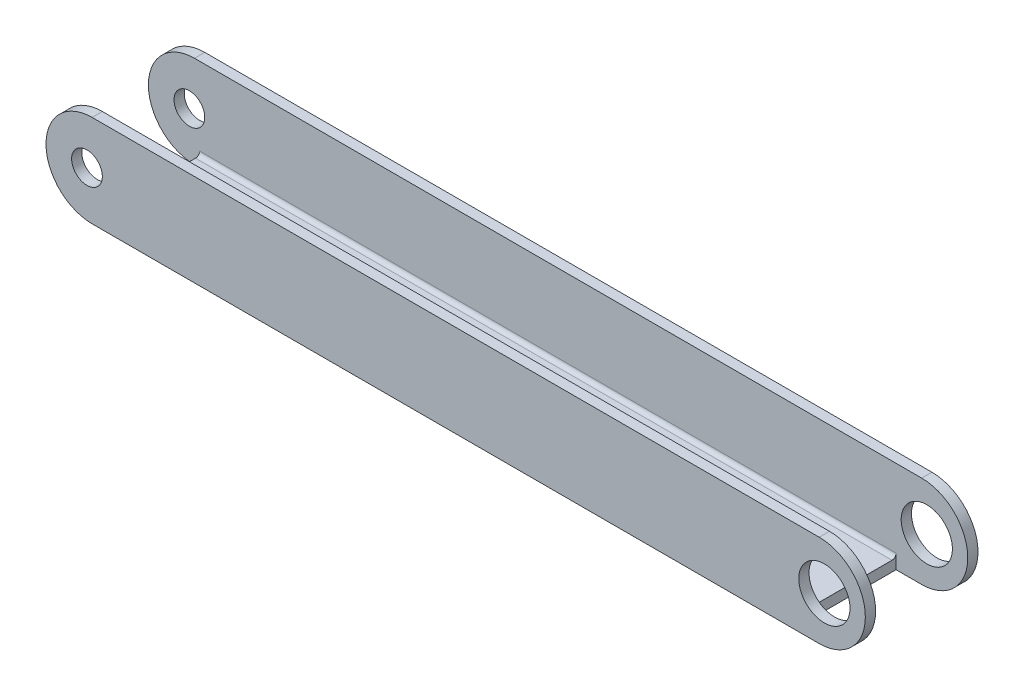
ISO-10303-21;
HEADER;
FILE_DESCRIPTION(('STEP AP214'),'2;1');
FILE_NAME('part.step','',(''),(''),'','','');
FILE_SCHEMA(('AUTOMOTIVE_DESIGN { 1 0 10303 214 1 1 1 1 }'));
ENDSEC;
DATA;
#1=APPLICATION_CONTEXT('core data for automotive mechanical design processes');
#2=APPLICATION_PROTOCOL_DEFINITION('international standard','automotive_design',2000,#1);
#3=PRODUCT_CONTEXT('',#1,'mechanical');
#4=PRODUCT('Part','Part','',(#3));
#5=PRODUCT_RELATED_PRODUCT_CATEGORY('part','',(#4));
#6=PRODUCT_DEFINITION_FORMATION('','',#4);
#7=PRODUCT_DEFINITION_CONTEXT('part definition',#1,'design');
#8=PRODUCT_DEFINITION('design','',#6,#7);
#9=PRODUCT_DEFINITION_SHAPE('','',#8);
#10=(LENGTH_UNIT() NAMED_UNIT(*) SI_UNIT(.MILLI.,.METRE.));
#11=(NAMED_UNIT(*) PLANE_ANGLE_UNIT() SI_UNIT($,.RADIAN.));
#12=(NAMED_UNIT(*) SI_UNIT($,.STERADIAN.) SOLID_ANGLE_UNIT());
#13=UNCERTAINTY_MEASURE_WITH_UNIT(LENGTH_MEASURE(1.E-05),#10,'distance_accuracy_value','');
#14=(GEOMETRIC_REPRESENTATION_CONTEXT(3) GLOBAL_UNCERTAINTY_ASSIGNED_CONTEXT((#13)) GLOBAL_UNIT_ASSIGNED_CONTEXT((#10,
#11,#12)) REPRESENTATION_CONTEXT('',''));
#15=CARTESIAN_POINT('',(0.,0.,0.));
#16=DIRECTION('',(0.,0.,1.));
#17=DIRECTION('',(1.,0.,0.));
#18=AXIS2_PLACEMENT_3D('',#15,#16,#17);
#19=CARTESIAN_POINT('',(177.5,17.5,27.5));
#20=DIRECTION('',(0.,0.,-1.));
#21=DIRECTION('',(-1.,0.,0.));
#22=AXIS2_PLACEMENT_3D('',#19,#20,#21);
#23=CYLINDRICAL_SURFACE('',#22,22.5);
#24=DIRECTION('',(0.,0.,1.));
#25=VECTOR('',#24,1.);
#26=CARTESIAN_POINT('',(177.5,40.,27.5));
#27=LINE('',#26,#25);
#28=CARTESIAN_POINT('',(177.5,40.,27.5));
#29=VERTEX_POINT('',#28);
#30=CARTESIAN_POINT('',(177.5,40.,22.5));
#31=VERTEX_POINT('',#30);
#32=EDGE_CURVE('E265',#29,#31,#27,.F.);
#33=ORIENTED_EDGE('',*,*,#32,.F.);
#34=CARTESIAN_POINT('',(177.5,17.5,27.5));
#35=DIRECTION('',(0.,0.,-1.));
#36=DIRECTION('',(-1.,0.,0.));
#37=AXIS2_PLACEMENT_3D('',#34,#35,#36);
#38=CIRCLE('',#37,22.5);
#39=CARTESIAN_POINT('',(177.5,-5.,27.5));
#40=VERTEX_POINT('',#39);
#41=EDGE_CURVE('E42',#40,#29,#38,.F.);
#42=ORIENTED_EDGE('',*,*,#41,.F.);
#43=DIRECTION('',(0.,0.,-1.));
#44=VECTOR('',#43,1.);
#45=CARTESIAN_POINT('',(177.5,-5.,22.5));
#46=LINE('',#45,#44);
#47=CARTESIAN_POINT('',(177.5,-5.,22.5));
#48=VERTEX_POINT('',#47);
#49=EDGE_CURVE('E268',#48,#40,#46,.F.);
#50=ORIENTED_EDGE('',*,*,#49,.F.);
#51=CARTESIAN_POINT('',(177.5,17.5,22.5));
#52=DIRECTION('',(0.,0.,-1.));
#53=DIRECTION('',(-1.,0.,0.));
#54=AXIS2_PLACEMENT_3D('',#51,#52,#53);
#55=CIRCLE('',#54,22.5);
#56=EDGE_CURVE('E11',#31,#48,#55,.T.);
#57=ORIENTED_EDGE('',*,*,#56,.F.);
#58=EDGE_LOOP('',(#33,#42,#50,#57));
#59=FACE_BOUND('',#58,.T.);
#60=ADVANCED_FACE('F34',(#59),#23,.T.);
#61=CARTESIAN_POINT('',(177.5,17.5,-22.5));
#62=DIRECTION('',(0.,0.,-1.));
#63=DIRECTION('',(-1.,0.,0.));
#64=AXIS2_PLACEMENT_3D('',#61,#62,#63);
#65=CYLINDRICAL_SURFACE('',#64,22.5);
#66=DIRECTION('',(0.,0.,1.));
#67=VECTOR('',#66,1.);
#68=CARTESIAN_POINT('',(177.5,40.,-22.5));
#69=LINE('',#68,#67);
#70=CARTESIAN_POINT('',(177.5,40.,-22.5));
#71=VERTEX_POINT('',#70);
#72=CARTESIAN_POINT('',(177.5,40.,-27.5));
#73=VERTEX_POINT('',#72);
#74=EDGE_CURVE('E255',#71,#73,#69,.F.);
#75=ORIENTED_EDGE('',*,*,#74,.F.);
#76=CARTESIAN_POINT('',(177.5,17.5,-22.5));
#77=DIRECTION('',(0.,0.,1.));
#78=DIRECTION('',(1.,0.,0.));
#79=AXIS2_PLACEMENT_3D('',#76,#77,#78);
#80=CIRCLE('',#79,22.5);
#81=CARTESIAN_POINT('',(177.5,-5.,-22.5));
#82=VERTEX_POINT('',#81);
#83=EDGE_CURVE('E261',#82,#71,#80,.T.);
#84=ORIENTED_EDGE('',*,*,#83,.F.);
#85=DIRECTION('',(0.,0.,-1.));
#86=VECTOR('',#85,1.);
#87=CARTESIAN_POINT('',(177.5,-5.,22.5));
#88=LINE('',#87,#86);
#89=CARTESIAN_POINT('',(177.5,-5.,-27.5));
#90=VERTEX_POINT('',#89);
#91=EDGE_CURVE('E258',#90,#82,#88,.F.);
#92=ORIENTED_EDGE('',*,*,#91,.F.);
#93=CARTESIAN_POINT('',(177.5,17.5,-27.5));
#94=DIRECTION('',(0.,0.,1.));
#95=DIRECTION('',(1.,0.,0.));
#96=AXIS2_PLACEMENT_3D('',#93,#94,#95);
#97=CIRCLE('',#96,22.5);
#98=EDGE_CURVE('E263',#73,#90,#97,.F.);
#99=ORIENTED_EDGE('',*,*,#98,.F.);
#100=EDGE_LOOP('',(#75,#84,#92,#99));
#101=FACE_BOUND('',#100,.T.);
#102=ADVANCED_FACE('F281',(#101),#65,.T.);
#103=CARTESIAN_POINT('',(-177.5,17.5,22.5));
#104=DIRECTION('',(0.,0.,-1.));
#105=DIRECTION('',(-1.,0.,0.));
#106=AXIS2_PLACEMENT_3D('',#103,#104,#105);
#107=CYLINDRICAL_SURFACE('',#106,22.5);
#108=DIRECTION('',(0.,0.,-1.));
#109=VECTOR('',#108,1.);
#110=CARTESIAN_POINT('',(-177.5,40.,27.5));
#111=LINE('',#110,#109);
#112=CARTESIAN_POINT('',(-177.5,40.,22.5));
#113=VERTEX_POINT('',#112);
#114=CARTESIAN_POINT('',(-177.5,40.,27.5));
#115=VERTEX_POINT('',#114);
#116=EDGE_CURVE('E228',#113,#115,#111,.F.);
#117=ORIENTED_EDGE('',*,*,#116,.F.);
#118=CARTESIAN_POINT('',(-177.5,17.5,22.5));
#119=DIRECTION('',(0.,0.,-1.));
#120=DIRECTION('',(-1.,0.,0.));
#121=AXIS2_PLACEMENT_3D('',#118,#119,#120);
#122=CIRCLE('',#121,22.5);
#123=CARTESIAN_POINT('',(-177.5,-5.,22.5));
#124=VERTEX_POINT('',#123);
#125=EDGE_CURVE('E232',#124,#113,#122,.T.);
#126=ORIENTED_EDGE('',*,*,#125,.F.);
#127=DIRECTION('',(0.,0.,1.));
#128=VECTOR('',#127,1.);
#129=CARTESIAN_POINT('',(-177.5,-5.,22.5));
#130=LINE('',#129,#128);
#131=CARTESIAN_POINT('',(-177.5,-5.,27.5));
#132=VERTEX_POINT('',#131);
#133=EDGE_CURVE('E142',#132,#124,#130,.F.);
#134=ORIENTED_EDGE('',*,*,#133,.F.);
#135=CARTESIAN_POINT('',(-177.5,17.5,27.5));
#136=DIRECTION('',(0.,0.,-1.));
#137=DIRECTION('',(-1.,0.,0.));
#138=AXIS2_PLACEMENT_3D('',#135,#136,#137);
#139=CIRCLE('',#138,22.5);
#140=EDGE_CURVE('E234',#115,#132,#139,.F.);
#141=ORIENTED_EDGE('',*,*,#140,.F.);
#142=EDGE_LOOP('',(#117,#126,#134,#141));
#143=FACE_BOUND('',#142,.T.);
#144=ADVANCED_FACE('F278',(#143),#107,.T.);
#145=CARTESIAN_POINT('',(-177.5,17.5,-27.5));
#146=DIRECTION('',(0.,0.,-1.));
#147=DIRECTION('',(-1.,0.,0.));
#148=AXIS2_PLACEMENT_3D('',#145,#146,#147);
#149=CYLINDRICAL_SURFACE('',#148,22.5);
#150=DIRECTION('',(0.,0.,-1.));
#151=VECTOR('',#150,1.);
#152=CARTESIAN_POINT('',(-177.5,40.,-22.5));
#153=LINE('',#152,#151);
#154=CARTESIAN_POINT('',(-177.5,40.,-27.5));
#155=VERTEX_POINT('',#154);
#156=CARTESIAN_POINT('',(-177.5,40.,-22.5));
#157=VERTEX_POINT('',#156);
#158=EDGE_CURVE('E217',#155,#157,#153,.F.);
#159=ORIENTED_EDGE('',*,*,#158,.F.);
#160=CARTESIAN_POINT('',(-177.5,17.5,-27.5));
#161=DIRECTION('',(0.,0.,1.));
#162=DIRECTION('',(1.,0.,0.));
#163=AXIS2_PLACEMENT_3D('',#160,#161,#162);
#164=CIRCLE('',#163,22.5);
#165=CARTESIAN_POINT('',(-177.5,-5.,-27.5));
#166=VERTEX_POINT('',#165);
#167=EDGE_CURVE('E223',#166,#155,#164,.F.);
#168=ORIENTED_EDGE('',*,*,#167,.F.);
#169=DIRECTION('',(0.,0.,1.));
#170=VECTOR('',#169,1.);
#171=CARTESIAN_POINT('',(-177.5,-5.,-27.5));
#172=LINE('',#171,#170);
#173=CARTESIAN_POINT('',(-177.5,-5.,-22.5));
#174=VERTEX_POINT('',#173);
#175=EDGE_CURVE('E220',#174,#166,#172,.F.);
#176=ORIENTED_EDGE('',*,*,#175,.F.);
#177=CARTESIAN_POINT('',(-177.5,17.5,-22.5));
#178=DIRECTION('',(0.,0.,1.));
#179=DIRECTION('',(1.,0.,0.));
#180=AXIS2_PLACEMENT_3D('',#177,#178,#179);
#181=CIRCLE('',#180,22.5);
#182=EDGE_CURVE('E226',#157,#174,#181,.T.);
#183=ORIENTED_EDGE('',*,*,#182,.F.);
#184=EDGE_LOOP('',(#159,#168,#176,#183));
#185=FACE_BOUND('',#184,.T.);
#186=ADVANCED_FACE('F280',(#185),#149,.T.);
#187=CARTESIAN_POINT('',(200.,0.,22.5));
#188=DIRECTION('',(0.,1.,0.));
#189=DIRECTION('',(0.,0.,1.));
#190=AXIS2_PLACEMENT_3D('',#187,#188,#189);
#191=PLANE('',#190);
#192=DIRECTION('',(0.,0.,1.));
#193=VECTOR('',#192,1.);
#194=CARTESIAN_POINT('',(-175.,0.,22.5));
#195=LINE('',#194,#193);
#196=CARTESIAN_POINT('',(-175.,0.,-20.5));
#197=VERTEX_POINT('',#196);
#198=CARTESIAN_POINT('',(-175.,0.,20.5));
#199=VERTEX_POINT('',#198);
#200=EDGE_CURVE('E154',#197,#199,#195,.T.);
#201=ORIENTED_EDGE('',*,*,#200,.T.);
#202=DIRECTION('',(-1.,0.,0.));
#203=VECTOR('',#202,1.);
#204=CARTESIAN_POINT('',(165.,0.,20.5));
#205=LINE('',#204,#203);
#206=CARTESIAN_POINT('',(165.,0.,20.5));
#207=VERTEX_POINT('',#206);
#208=EDGE_CURVE('E241',#199,#207,#205,.F.);
#209=ORIENTED_EDGE('',*,*,#208,.T.);
#210=DIRECTION('',(0.,0.,-1.));
#211=VECTOR('',#210,1.);
#212=CARTESIAN_POINT('',(165.,0.,22.5));
#213=LINE('',#212,#211);
#214=CARTESIAN_POINT('',(165.,0.,-20.5));
#215=VERTEX_POINT('',#214);
#216=EDGE_CURVE('E178',#207,#215,#213,.T.);
#217=ORIENTED_EDGE('',*,*,#216,.T.);
#218=DIRECTION('',(-1.,0.,0.));
#219=VECTOR('',#218,1.);
#220=CARTESIAN_POINT('',(-175.,0.,-20.5));
#221=LINE('',#220,#219);
#222=EDGE_CURVE('E238',#215,#197,#221,.T.);
#223=ORIENTED_EDGE('',*,*,#222,.T.);
#224=EDGE_LOOP('',(#201,#209,#217,#223));
#225=FACE_BOUND('',#224,.T.);
#226=ADVANCED_FACE('F287',(#225),#191,.T.);
#227=CARTESIAN_POINT('',(200.,-5.,22.5));
#228=DIRECTION('',(0.,1.,0.));
#229=DIRECTION('',(0.,0.,1.));
#230=AXIS2_PLACEMENT_3D('',#227,#228,#229);
#231=PLANE('',#230);
#232=DIRECTION('',(1.,0.,0.));
#233=VECTOR('',#232,1.);
#234=CARTESIAN_POINT('',(165.,-5.,22.5));
#235=LINE('',#234,#233);
#236=CARTESIAN_POINT('',(165.,-5.,22.5));
#237=VERTEX_POINT('',#236);
#238=EDGE_CURVE('E166',#237,#48,#235,.T.);
#239=ORIENTED_EDGE('',*,*,#238,.T.);
#240=ORIENTED_EDGE('',*,*,#49,.T.);
#241=DIRECTION('',(-1.,0.,0.));
#242=VECTOR('',#241,1.);
#243=CARTESIAN_POINT('',(200.,-5.,27.5));
#244=LINE('',#243,#242);
#245=EDGE_CURVE('E207',#40,#132,#244,.T.);
#246=ORIENTED_EDGE('',*,*,#245,.T.);
#247=ORIENTED_EDGE('',*,*,#133,.T.);
#248=DIRECTION('',(1.,0.,0.));
#249=VECTOR('',#248,1.);
#250=CARTESIAN_POINT('',(-200.,-5.,22.5));
#251=LINE('',#250,#249);
#252=CARTESIAN_POINT('',(-175.,-5.,22.5));
#253=VERTEX_POINT('',#252);
#254=EDGE_CURVE('E134',#124,#253,#251,.T.);
#255=ORIENTED_EDGE('',*,*,#254,.T.);
#256=DIRECTION('',(0.,0.,-1.));
#257=VECTOR('',#256,1.);
#258=CARTESIAN_POINT('',(-175.,-5.,22.5));
#259=LINE('',#258,#257);
#260=CARTESIAN_POINT('',(-175.,-5.,-22.5));
#261=VERTEX_POINT('',#260);
#262=EDGE_CURVE('E140',#253,#261,#259,.T.);
#263=ORIENTED_EDGE('',*,*,#262,.T.);
#264=DIRECTION('',(-1.,0.,0.));
#265=VECTOR('',#264,1.);
#266=CARTESIAN_POINT('',(-175.,-5.,-22.5));
#267=LINE('',#266,#265);
#268=EDGE_CURVE('E144',#261,#174,#267,.T.);
#269=ORIENTED_EDGE('',*,*,#268,.T.);
#270=ORIENTED_EDGE('',*,*,#175,.T.);
#271=DIRECTION('',(-1.,0.,0.));
#272=VECTOR('',#271,1.);
#273=CARTESIAN_POINT('',(200.,-5.,-27.5));
#274=LINE('',#273,#272);
#275=EDGE_CURVE('E205',#90,#166,#274,.T.);
#276=ORIENTED_EDGE('',*,*,#275,.F.);
#277=ORIENTED_EDGE('',*,*,#91,.T.);
#278=DIRECTION('',(-1.,0.,0.));
#279=VECTOR('',#278,1.);
#280=CARTESIAN_POINT('',(200.,-5.,-22.5));
#281=LINE('',#280,#279);
#282=CARTESIAN_POINT('',(165.,-5.,-22.5));
#283=VERTEX_POINT('',#282);
#284=EDGE_CURVE('E168',#82,#283,#281,.T.);
#285=ORIENTED_EDGE('',*,*,#284,.T.);
#286=DIRECTION('',(0.,0.,1.));
#287=VECTOR('',#286,1.);
#288=CARTESIAN_POINT('',(165.,-5.,-22.5));
#289=LINE('',#288,#287);
#290=EDGE_CURVE('E170',#283,#237,#289,.T.);
#291=ORIENTED_EDGE('',*,*,#290,.T.);
#292=EDGE_LOOP('',(#239,#240,#246,#247,#255,#263,#269,#270,#276,#277,#285,#291));
#293=FACE_BOUND('',#292,.T.);
#294=ADVANCED_FACE('F137',(#293),#231,.F.);
#295=CARTESIAN_POINT('',(200.,0.,-27.5));
#296=DIRECTION('',(0.,0.,1.));
#297=DIRECTION('',(1.,0.,0.));
#298=AXIS2_PLACEMENT_3D('',#295,#296,#297);
#299=PLANE('',#298);
#300=CARTESIAN_POINT('',(180.,17.5,-27.5));
#301=DIRECTION('',(0.,0.,1.));
#302=DIRECTION('',(1.,0.,0.));
#303=AXIS2_PLACEMENT_3D('',#300,#301,#302);
#304=CIRCLE('',#303,12.5);
#305=CARTESIAN_POINT('',(192.5,17.5,-27.5));
#306=VERTEX_POINT('',#305);
#307=EDGE_CURVE('E184',#306,#306,#304,.T.);
#308=ORIENTED_EDGE('',*,*,#307,.T.);
#309=EDGE_LOOP('',(#308));
#310=FACE_BOUND('',#309,.T.);
#311=CARTESIAN_POINT('',(-180.,17.5,-27.5));
#312=DIRECTION('',(0.,0.,1.));
#313=DIRECTION('',(1.,0.,0.));
#314=AXIS2_PLACEMENT_3D('',#311,#312,#313);
#315=CIRCLE('',#314,7.50000000000001);
#316=CARTESIAN_POINT('',(-172.5,17.5,-27.5));
#317=VERTEX_POINT('',#316);
#318=EDGE_CURVE('E196',#317,#317,#315,.T.);
#319=ORIENTED_EDGE('',*,*,#318,.T.);
#320=EDGE_LOOP('',(#319));
#321=FACE_BOUND('',#320,.T.);
#322=DIRECTION('',(-1.,0.,0.));
#323=VECTOR('',#322,1.);
#324=CARTESIAN_POINT('',(200.,40.,-27.5));
#325=LINE('',#324,#323);
#326=EDGE_CURVE('E215',#73,#155,#325,.T.);
#327=ORIENTED_EDGE('',*,*,#326,.F.);
#328=ORIENTED_EDGE('',*,*,#98,.T.);
#329=ORIENTED_EDGE('',*,*,#275,.T.);
#330=ORIENTED_EDGE('',*,*,#167,.T.);
#331=EDGE_LOOP('',(#327,#328,#329,#330));
#332=FACE_BOUND('',#331,.T.);
#333=ADVANCED_FACE('F313',(#310,#321,#332),#299,.F.);
#334=CARTESIAN_POINT('',(200.,40.,-22.5));
#335=DIRECTION('',(0.,1.,0.));
#336=DIRECTION('',(0.,0.,1.));
#337=AXIS2_PLACEMENT_3D('',#334,#335,#336);
#338=PLANE('',#337);
#339=DIRECTION('',(-1.,0.,0.));
#340=VECTOR('',#339,1.);
#341=CARTESIAN_POINT('',(200.,40.,-22.5));
#342=LINE('',#341,#340);
#343=EDGE_CURVE('E213',#71,#157,#342,.T.);
#344=ORIENTED_EDGE('',*,*,#343,.F.);
#345=ORIENTED_EDGE('',*,*,#74,.T.);
#346=ORIENTED_EDGE('',*,*,#326,.T.);
#347=ORIENTED_EDGE('',*,*,#158,.T.);
#348=EDGE_LOOP('',(#344,#345,#346,#347));
#349=FACE_BOUND('',#348,.T.);
#350=ADVANCED_FACE('F318',(#349),#338,.T.);
#351=CARTESIAN_POINT('',(200.,0.,-22.5));
#352=DIRECTION('',(0.,0.,1.));
#353=DIRECTION('',(1.,0.,0.));
#354=AXIS2_PLACEMENT_3D('',#351,#352,#353);
#355=PLANE('',#354);
#356=CARTESIAN_POINT('',(-180.,17.5,-22.5));
#357=DIRECTION('',(0.,0.,1.));
#358=DIRECTION('',(1.,0.,0.));
#359=AXIS2_PLACEMENT_3D('',#356,#357,#358);
#360=CIRCLE('',#359,7.50000000000001);
#361=CARTESIAN_POINT('',(-172.5,17.5,-22.5));
#362=VERTEX_POINT('',#361);
#363=EDGE_CURVE('E202',#362,#362,#360,.T.);
#364=ORIENTED_EDGE('',*,*,#363,.F.);
#365=EDGE_LOOP('',(#364));
#366=FACE_BOUND('',#365,.T.);
#367=ORIENTED_EDGE('',*,*,#284,.F.);
#368=ORIENTED_EDGE('',*,*,#83,.T.);
#369=ORIENTED_EDGE('',*,*,#343,.T.);
#370=ORIENTED_EDGE('',*,*,#182,.T.);
#371=ORIENTED_EDGE('',*,*,#268,.F.);
#372=DIRECTION('',(0.,-1.,0.));
#373=VECTOR('',#372,1.);
#374=CARTESIAN_POINT('',(-175.,40.,-22.5));
#375=LINE('',#374,#373);
#376=CARTESIAN_POINT('',(-175.,2.,-22.5));
#377=VERTEX_POINT('',#376);
#378=EDGE_CURVE('E155',#377,#261,#375,.T.);
#379=ORIENTED_EDGE('',*,*,#378,.F.);
#380=DIRECTION('',(-1.,0.,0.));
#381=VECTOR('',#380,1.);
#382=CARTESIAN_POINT('',(165.,2.,-22.5));
#383=LINE('',#382,#381);
#384=CARTESIAN_POINT('',(165.,2.00000000000002,-22.5));
#385=VERTEX_POINT('',#384);
#386=EDGE_CURVE('E243',#377,#385,#383,.F.);
#387=ORIENTED_EDGE('',*,*,#386,.T.);
#388=DIRECTION('',(0.,-1.,0.));
#389=VECTOR('',#388,1.);
#390=CARTESIAN_POINT('',(165.,40.,-22.5));
#391=LINE('',#390,#389);
#392=EDGE_CURVE('E175',#385,#283,#391,.T.);
#393=ORIENTED_EDGE('',*,*,#392,.T.);
#394=EDGE_LOOP('',(#367,#368,#369,#370,#371,#379,#387,#393));
#395=FACE_BOUND('',#394,.T.);
#396=CARTESIAN_POINT('',(180.,17.5,-22.5));
#397=DIRECTION('',(0.,0.,1.));
#398=DIRECTION('',(1.,0.,0.));
#399=AXIS2_PLACEMENT_3D('',#396,#397,#398);
#400=CIRCLE('',#399,12.5);
#401=CARTESIAN_POINT('',(192.5,17.5,-22.5));
#402=VERTEX_POINT('',#401);
#403=EDGE_CURVE('E190',#402,#402,#400,.T.);
#404=ORIENTED_EDGE('',*,*,#403,.F.);
#405=EDGE_LOOP('',(#404));
#406=FACE_BOUND('',#405,.T.);
#407=ADVANCED_FACE('F328',(#366,#395,#406),#355,.T.);
#408=CARTESIAN_POINT('',(200.,40.,22.5));
#409=DIRECTION('',(0.,0.,-1.));
#410=DIRECTION('',(-1.,0.,0.));
#411=AXIS2_PLACEMENT_3D('',#408,#409,#410);
#412=PLANE('',#411);
#413=CARTESIAN_POINT('',(-180.,17.5,22.5));
#414=DIRECTION('',(0.,0.,-1.));
#415=DIRECTION('',(-1.,0.,0.));
#416=AXIS2_PLACEMENT_3D('',#413,#414,#415);
#417=CIRCLE('',#416,7.50000000000001);
#418=CARTESIAN_POINT('',(-187.5,17.5,22.5));
#419=VERTEX_POINT('',#418);
#420=EDGE_CURVE('E199',#419,#419,#417,.T.);
#421=ORIENTED_EDGE('',*,*,#420,.F.);
#422=EDGE_LOOP('',(#421));
#423=FACE_BOUND('',#422,.T.);
#424=DIRECTION('',(-1.,0.,0.));
#425=VECTOR('',#424,1.);
#426=CARTESIAN_POINT('',(200.,40.,22.5));
#427=LINE('',#426,#425);
#428=EDGE_CURVE('E211',#31,#113,#427,.T.);
#429=ORIENTED_EDGE('',*,*,#428,.F.);
#430=ORIENTED_EDGE('',*,*,#56,.T.);
#431=ORIENTED_EDGE('',*,*,#238,.F.);
#432=DIRECTION('',(0.,-1.,0.));
#433=VECTOR('',#432,1.);
#434=CARTESIAN_POINT('',(165.,40.,22.5));
#435=LINE('',#434,#433);
#436=CARTESIAN_POINT('',(165.,2.00000000000002,22.5));
#437=VERTEX_POINT('',#436);
#438=EDGE_CURVE('E173',#437,#237,#435,.T.);
#439=ORIENTED_EDGE('',*,*,#438,.F.);
#440=DIRECTION('',(-1.,0.,0.));
#441=VECTOR('',#440,1.);
#442=CARTESIAN_POINT('',(-175.,2.,22.5));
#443=LINE('',#442,#441);
#444=CARTESIAN_POINT('',(-175.,2.,22.5));
#445=VERTEX_POINT('',#444);
#446=EDGE_CURVE('E151',#437,#445,#443,.T.);
#447=ORIENTED_EDGE('',*,*,#446,.T.);
#448=DIRECTION('',(0.,-1.,0.));
#449=VECTOR('',#448,1.);
#450=CARTESIAN_POINT('',(-175.,40.,22.5));
#451=LINE('',#450,#449);
#452=EDGE_CURVE('E147',#445,#253,#451,.T.);
#453=ORIENTED_EDGE('',*,*,#452,.T.);
#454=ORIENTED_EDGE('',*,*,#254,.F.);
#455=ORIENTED_EDGE('',*,*,#125,.T.);
#456=EDGE_LOOP('',(#429,#430,#431,#439,#447,#453,#454,#455));
#457=FACE_BOUND('',#456,.T.);
#458=CARTESIAN_POINT('',(180.,17.5,22.5));
#459=DIRECTION('',(0.,0.,-1.));
#460=DIRECTION('',(-1.,0.,0.));
#461=AXIS2_PLACEMENT_3D('',#458,#459,#460);
#462=CIRCLE('',#461,12.5);
#463=CARTESIAN_POINT('',(167.5,17.5,22.5));
#464=VERTEX_POINT('',#463);
#465=EDGE_CURVE('E187',#464,#464,#462,.T.);
#466=ORIENTED_EDGE('',*,*,#465,.F.);
#467=EDGE_LOOP('',(#466));
#468=FACE_BOUND('',#467,.T.);
#469=ADVANCED_FACE('F148',(#423,#457,#468),#412,.T.);
#470=CARTESIAN_POINT('',(200.,40.,27.5));
#471=DIRECTION('',(0.,1.,0.));
#472=DIRECTION('',(0.,0.,1.));
#473=AXIS2_PLACEMENT_3D('',#470,#471,#472);
#474=PLANE('',#473);
#475=DIRECTION('',(-1.,0.,0.));
#476=VECTOR('',#475,1.);
#477=CARTESIAN_POINT('',(200.,40.,27.5));
#478=LINE('',#477,#476);
#479=EDGE_CURVE('E209',#29,#115,#478,.T.);
#480=ORIENTED_EDGE('',*,*,#479,.F.);
#481=ORIENTED_EDGE('',*,*,#32,.T.);
#482=ORIENTED_EDGE('',*,*,#428,.T.);
#483=ORIENTED_EDGE('',*,*,#116,.T.);
#484=EDGE_LOOP('',(#480,#481,#482,#483));
#485=FACE_BOUND('',#484,.T.);
#486=ADVANCED_FACE('F275',(#485),#474,.T.);
#487=CARTESIAN_POINT('',(200.,40.,27.5));
#488=DIRECTION('',(0.,0.,-1.));
#489=DIRECTION('',(-1.,0.,0.));
#490=AXIS2_PLACEMENT_3D('',#487,#488,#489);
#491=PLANE('',#490);
#492=CARTESIAN_POINT('',(180.,17.5,27.5));
#493=DIRECTION('',(0.,0.,1.));
#494=DIRECTION('',(1.,0.,0.));
#495=AXIS2_PLACEMENT_3D('',#492,#493,#494);
#496=CIRCLE('',#495,12.5);
#497=CARTESIAN_POINT('',(192.5,17.5,27.5));
#498=VERTEX_POINT('',#497);
#499=EDGE_CURVE('E181',#498,#498,#496,.T.);
#500=ORIENTED_EDGE('',*,*,#499,.F.);
#501=EDGE_LOOP('',(#500));
#502=FACE_BOUND('',#501,.T.);
#503=CARTESIAN_POINT('',(-180.,17.5,27.5));
#504=DIRECTION('',(0.,0.,1.));
#505=DIRECTION('',(1.,0.,0.));
#506=AXIS2_PLACEMENT_3D('',#503,#504,#505);
#507=CIRCLE('',#506,7.50000000000001);
#508=CARTESIAN_POINT('',(-172.5,17.5,27.5));
#509=VERTEX_POINT('',#508);
#510=EDGE_CURVE('E193',#509,#509,#507,.T.);
#511=ORIENTED_EDGE('',*,*,#510,.F.);
#512=EDGE_LOOP('',(#511));
#513=FACE_BOUND('',#512,.T.);
#514=ORIENTED_EDGE('',*,*,#245,.F.);
#515=ORIENTED_EDGE('',*,*,#41,.T.);
#516=ORIENTED_EDGE('',*,*,#479,.T.);
#517=ORIENTED_EDGE('',*,*,#140,.T.);
#518=EDGE_LOOP('',(#514,#515,#516,#517));
#519=FACE_BOUND('',#518,.T.);
#520=ADVANCED_FACE('F271',(#502,#513,#519),#491,.F.);
#521=CARTESIAN_POINT('',(-180.,17.5,-27.5));
#522=DIRECTION('',(0.,0.,1.));
#523=DIRECTION('',(1.,0.,0.));
#524=AXIS2_PLACEMENT_3D('',#521,#522,#523);
#525=CYLINDRICAL_SURFACE('',#524,7.50000000000001);
#526=ORIENTED_EDGE('',*,*,#420,.T.);
#527=EDGE_LOOP('',(#526));
#528=FACE_BOUND('',#527,.T.);
#529=ORIENTED_EDGE('',*,*,#510,.T.);
#530=EDGE_LOOP('',(#529));
#531=FACE_BOUND('',#530,.T.);
#532=ADVANCED_FACE('F362',(#528,#531),#525,.F.);
#533=ORIENTED_EDGE('',*,*,#363,.T.);
#534=EDGE_LOOP('',(#533));
#535=FACE_BOUND('',#534,.T.);
#536=ORIENTED_EDGE('',*,*,#318,.F.);
#537=EDGE_LOOP('',(#536));
#538=FACE_BOUND('',#537,.T.);
#539=ADVANCED_FACE('F370',(#535,#538),#525,.F.);
#540=CARTESIAN_POINT('',(180.,17.5,-27.5));
#541=DIRECTION('',(0.,0.,1.));
#542=DIRECTION('',(1.,0.,0.));
#543=AXIS2_PLACEMENT_3D('',#540,#541,#542);
#544=CYLINDRICAL_SURFACE('',#543,12.5);
#545=ORIENTED_EDGE('',*,*,#465,.T.);
#546=EDGE_LOOP('',(#545));
#547=FACE_BOUND('',#546,.T.);
#548=ORIENTED_EDGE('',*,*,#499,.T.);
#549=EDGE_LOOP('',(#548));
#550=FACE_BOUND('',#549,.T.);
#551=ADVANCED_FACE('F379',(#547,#550),#544,.F.);
#552=ORIENTED_EDGE('',*,*,#403,.T.);
#553=EDGE_LOOP('',(#552));
#554=FACE_BOUND('',#553,.T.);
#555=ORIENTED_EDGE('',*,*,#307,.F.);
#556=EDGE_LOOP('',(#555));
#557=FACE_BOUND('',#556,.T.);
#558=ADVANCED_FACE('F387',(#554,#557),#544,.F.);
#559=CARTESIAN_POINT('',(165.,40.,-22.5));
#560=DIRECTION('',(1.,0.,0.));
#561=DIRECTION('',(0.,0.,-1.));
#562=AXIS2_PLACEMENT_3D('',#559,#560,#561);
#563=PLANE('',#562);
#564=ORIENTED_EDGE('',*,*,#438,.T.);
#565=ORIENTED_EDGE('',*,*,#290,.F.);
#566=ORIENTED_EDGE('',*,*,#392,.F.);
#567=CARTESIAN_POINT('',(165.,2.,-20.5));
#568=DIRECTION('',(1.,0.,0.));
#569=DIRECTION('',(0.,0.,-1.));
#570=AXIS2_PLACEMENT_3D('',#567,#568,#569);
#571=CIRCLE('',#570,2.);
#572=EDGE_CURVE('E253',#385,#215,#571,.F.);
#573=ORIENTED_EDGE('',*,*,#572,.T.);
#574=ORIENTED_EDGE('',*,*,#216,.F.);
#575=CARTESIAN_POINT('',(165.,2.,20.5));
#576=DIRECTION('',(1.,0.,0.));
#577=DIRECTION('',(0.,0.,-1.));
#578=AXIS2_PLACEMENT_3D('',#575,#576,#577);
#579=CIRCLE('',#578,2.);
#580=EDGE_CURVE('E248',#207,#437,#579,.F.);
#581=ORIENTED_EDGE('',*,*,#580,.T.);
#582=EDGE_LOOP('',(#564,#565,#566,#573,#574,#581));
#583=FACE_BOUND('',#582,.T.);
#584=ADVANCED_FACE('F394',(#583),#563,.T.);
#585=CARTESIAN_POINT('',(-175.,40.,22.5));
#586=DIRECTION('',(-1.,0.,0.));
#587=DIRECTION('',(0.,0.,1.));
#588=AXIS2_PLACEMENT_3D('',#585,#586,#587);
#589=PLANE('',#588);
#590=ORIENTED_EDGE('',*,*,#378,.T.);
#591=ORIENTED_EDGE('',*,*,#262,.F.);
#592=ORIENTED_EDGE('',*,*,#452,.F.);
#593=CARTESIAN_POINT('',(-175.,2.,20.5));
#594=DIRECTION('',(-1.,0.,0.));
#595=DIRECTION('',(0.,0.,1.));
#596=AXIS2_PLACEMENT_3D('',#593,#594,#595);
#597=CIRCLE('',#596,2.);
#598=EDGE_CURVE('E246',#445,#199,#597,.F.);
#599=ORIENTED_EDGE('',*,*,#598,.T.);
#600=ORIENTED_EDGE('',*,*,#200,.F.);
#601=CARTESIAN_POINT('',(-175.,2.,-20.5));
#602=DIRECTION('',(-1.,0.,0.));
#603=DIRECTION('',(0.,0.,1.));
#604=AXIS2_PLACEMENT_3D('',#601,#602,#603);
#605=CIRCLE('',#604,2.);
#606=EDGE_CURVE('E251',#197,#377,#605,.F.);
#607=ORIENTED_EDGE('',*,*,#606,.T.);
#608=EDGE_LOOP('',(#590,#591,#592,#599,#600,#607));
#609=FACE_BOUND('',#608,.T.);
#610=ADVANCED_FACE('F157',(#609),#589,.T.);
#611=CARTESIAN_POINT('',(200.,2.,20.5));
#612=DIRECTION('',(1.,0.,0.));
#613=DIRECTION('',(0.,0.,-1.));
#614=AXIS2_PLACEMENT_3D('',#611,#612,#613);
#615=CYLINDRICAL_SURFACE('',#614,2.);
#616=ORIENTED_EDGE('',*,*,#580,.F.);
#617=ORIENTED_EDGE('',*,*,#208,.F.);
#618=ORIENTED_EDGE('',*,*,#598,.F.);
#619=ORIENTED_EDGE('',*,*,#446,.F.);
#620=EDGE_LOOP('',(#616,#617,#618,#619));
#621=FACE_BOUND('',#620,.T.);
#622=ADVANCED_FACE('F409',(#621),#615,.F.);
#623=CARTESIAN_POINT('',(200.,2.,-20.5));
#624=DIRECTION('',(1.,0.,0.));
#625=DIRECTION('',(0.,0.,-1.));
#626=AXIS2_PLACEMENT_3D('',#623,#624,#625);
#627=CYLINDRICAL_SURFACE('',#626,2.);
#628=ORIENTED_EDGE('',*,*,#572,.F.);
#629=ORIENTED_EDGE('',*,*,#386,.F.);
#630=ORIENTED_EDGE('',*,*,#606,.F.);
#631=ORIENTED_EDGE('',*,*,#222,.F.);
#632=EDGE_LOOP('',(#628,#629,#630,#631));
#633=FACE_BOUND('',#632,.T.);
#634=ADVANCED_FACE('F309',(#633),#627,.F.);
#635=CLOSED_SHELL('',(#60,#102,#144,#186,#226,#294,#333,#350,#407,#469,#486,#520,#532,#539,#551,
#558,#584,#610,#622,#634));
#636=MANIFOLD_SOLID_BREP('B2',#635);
#637=ADVANCED_BREP_SHAPE_REPRESENTATION('',(#18,#636),#14);
#638=SHAPE_DEFINITION_REPRESENTATION(#9,#637);
ENDSEC;
END-ISO-10303-21;
